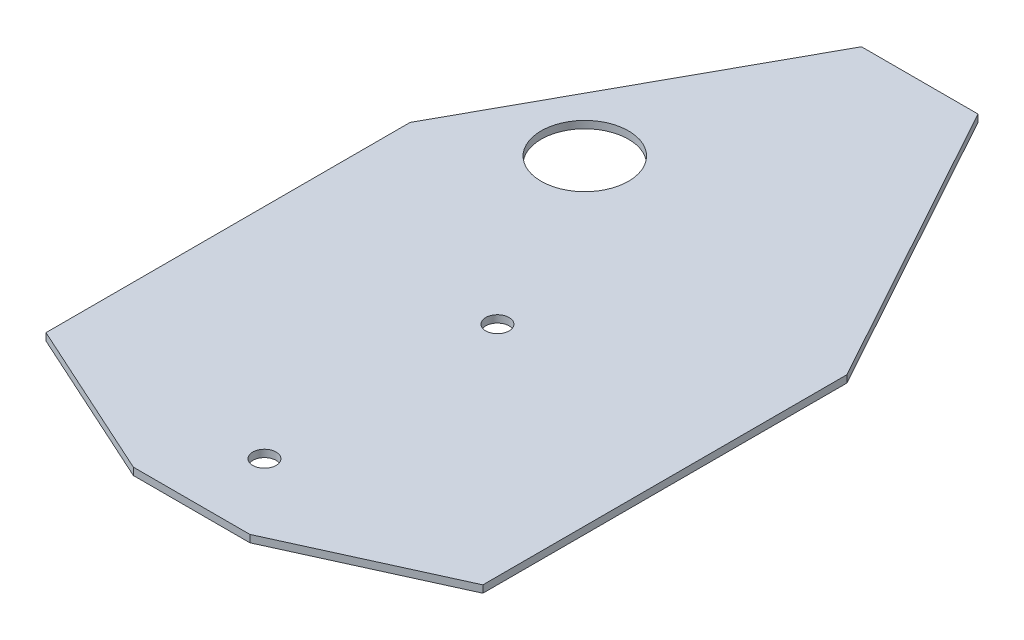
ISO-10303-21;
HEADER;
FILE_DESCRIPTION(('STEP AP214'),'2;1');
FILE_NAME('part.step','',(''),(''),'','','');
FILE_SCHEMA(('AUTOMOTIVE_DESIGN { 1 0 10303 214 1 1 1 1 }'));
ENDSEC;
DATA;
#1=APPLICATION_CONTEXT('core data for automotive mechanical design processes');
#2=APPLICATION_PROTOCOL_DEFINITION('international standard','automotive_design',2000,#1);
#3=PRODUCT_CONTEXT('',#1,'mechanical');
#4=PRODUCT('Part','Part','',(#3));
#5=PRODUCT_RELATED_PRODUCT_CATEGORY('part','',(#4));
#6=PRODUCT_DEFINITION_FORMATION('','',#4);
#7=PRODUCT_DEFINITION_CONTEXT('part definition',#1,'design');
#8=PRODUCT_DEFINITION('design','',#6,#7);
#9=PRODUCT_DEFINITION_SHAPE('','',#8);
#10=(LENGTH_UNIT() NAMED_UNIT(*) SI_UNIT(.MILLI.,.METRE.));
#11=(NAMED_UNIT(*) PLANE_ANGLE_UNIT() SI_UNIT($,.RADIAN.));
#12=(NAMED_UNIT(*) SI_UNIT($,.STERADIAN.) SOLID_ANGLE_UNIT());
#13=UNCERTAINTY_MEASURE_WITH_UNIT(LENGTH_MEASURE(1.E-05),#10,'distance_accuracy_value','');
#14=(GEOMETRIC_REPRESENTATION_CONTEXT(3) GLOBAL_UNCERTAINTY_ASSIGNED_CONTEXT((#13)) GLOBAL_UNIT_ASSIGNED_CONTEXT((#10,
#11,#12)) REPRESENTATION_CONTEXT('',''));
#15=CARTESIAN_POINT('',(0.,0.,0.));
#16=DIRECTION('',(0.,0.,1.));
#17=DIRECTION('',(1.,0.,0.));
#18=AXIS2_PLACEMENT_3D('',#15,#16,#17);
#19=CARTESIAN_POINT('',(-30.,1.,-90.));
#20=DIRECTION('',(0.,-1.,0.));
#21=DIRECTION('',(0.,0.,-1.));
#22=AXIS2_PLACEMENT_3D('',#19,#20,#21);
#23=PLANE('',#22);
#24=CARTESIAN_POINT('',(0.,1.,-32.));
#25=DIRECTION('',(0.,1.,0.));
#26=DIRECTION('',(0.,0.,1.));
#27=AXIS2_PLACEMENT_3D('',#24,#25,#26);
#28=CIRCLE('',#27,1.6);
#29=CARTESIAN_POINT('',(0.,1.,-30.4));
#30=VERTEX_POINT('',#29);
#31=EDGE_CURVE('E228',#30,#30,#28,.T.);
#32=ORIENTED_EDGE('',*,*,#31,.F.);
#33=EDGE_LOOP('',(#32));
#34=FACE_BOUND('',#33,.T.);
#35=DIRECTION('',(-1.,0.,0.));
#36=VECTOR('',#35,1.);
#37=CARTESIAN_POINT('',(-7.99999999999999,1.,-90.));
#38=LINE('',#37,#36);
#39=CARTESIAN_POINT('',(7.99999999999999,1.,-90.));
#40=VERTEX_POINT('',#39);
#41=CARTESIAN_POINT('',(-7.99999999999999,1.,-90.));
#42=VERTEX_POINT('',#41);
#43=EDGE_CURVE('E133',#40,#42,#38,.T.);
#44=ORIENTED_EDGE('',*,*,#43,.T.);
#45=DIRECTION('',(-0.481918749772156,0.,0.876215908676647));
#46=VECTOR('',#45,1.);
#47=CARTESIAN_POINT('',(-7.99999999999999,1.,-90.));
#48=LINE('',#47,#46);
#49=CARTESIAN_POINT('',(-30.,1.,-50.));
#50=VERTEX_POINT('',#49);
#51=EDGE_CURVE('E110',#42,#50,#48,.T.);
#52=ORIENTED_EDGE('',*,*,#51,.T.);
#53=DIRECTION('',(0.,0.,1.));
#54=VECTOR('',#53,1.);
#55=CARTESIAN_POINT('',(-30.,1.,-50.));
#56=LINE('',#55,#54);
#57=CARTESIAN_POINT('',(-30.,1.,0.));
#58=VERTEX_POINT('',#57);
#59=EDGE_CURVE('E136',#50,#58,#56,.T.);
#60=ORIENTED_EDGE('',*,*,#59,.T.);
#61=DIRECTION('',(0.910366477462605,0.,0.413802944301184));
#62=VECTOR('',#61,1.);
#63=CARTESIAN_POINT('',(-7.99999999999999,1.,10.));
#64=LINE('',#63,#62);
#65=CARTESIAN_POINT('',(-7.99999999999999,1.,10.));
#66=VERTEX_POINT('',#65);
#67=EDGE_CURVE('E138',#58,#66,#64,.T.);
#68=ORIENTED_EDGE('',*,*,#67,.T.);
#69=DIRECTION('',(1.,0.,0.));
#70=VECTOR('',#69,1.);
#71=CARTESIAN_POINT('',(-7.99999999999999,1.,10.));
#72=LINE('',#71,#70);
#73=CARTESIAN_POINT('',(8.,1.,10.));
#74=VERTEX_POINT('',#73);
#75=EDGE_CURVE('E140',#66,#74,#72,.T.);
#76=ORIENTED_EDGE('',*,*,#75,.T.);
#77=DIRECTION('',(0.910366477462605,0.,-0.413802944301184));
#78=VECTOR('',#77,1.);
#79=CARTESIAN_POINT('',(30.,1.,0.));
#80=LINE('',#79,#78);
#81=CARTESIAN_POINT('',(30.,1.,0.));
#82=VERTEX_POINT('',#81);
#83=EDGE_CURVE('E142',#74,#82,#80,.T.);
#84=ORIENTED_EDGE('',*,*,#83,.T.);
#85=DIRECTION('',(0.,0.,-1.));
#86=VECTOR('',#85,1.);
#87=CARTESIAN_POINT('',(30.,1.,-50.));
#88=LINE('',#87,#86);
#89=CARTESIAN_POINT('',(30.,1.,-50.));
#90=VERTEX_POINT('',#89);
#91=EDGE_CURVE('E51',#82,#90,#88,.T.);
#92=ORIENTED_EDGE('',*,*,#91,.T.);
#93=DIRECTION('',(-0.481918749772156,0.,-0.876215908676647));
#94=VECTOR('',#93,1.);
#95=CARTESIAN_POINT('',(7.99999999999999,1.,-90.));
#96=LINE('',#95,#94);
#97=EDGE_CURVE('E46',#90,#40,#96,.T.);
#98=ORIENTED_EDGE('',*,*,#97,.T.);
#99=EDGE_LOOP('',(#44,#52,#60,#68,#76,#84,#92,#98));
#100=FACE_BOUND('',#99,.T.);
#101=CARTESIAN_POINT('',(0.,1.,0.));
#102=DIRECTION('',(0.,1.,0.));
#103=DIRECTION('',(0.,0.,1.));
#104=AXIS2_PLACEMENT_3D('',#101,#102,#103);
#105=CIRCLE('',#104,1.6);
#106=CARTESIAN_POINT('',(0.,1.,1.6));
#107=VERTEX_POINT('',#106);
#108=EDGE_CURVE('E115',#107,#107,#105,.T.);
#109=ORIENTED_EDGE('',*,*,#108,.F.);
#110=EDGE_LOOP('',(#109));
#111=FACE_BOUND('',#110,.T.);
#112=CARTESIAN_POINT('',(-14.,1.,-58.));
#113=DIRECTION('',(0.,1.,0.));
#114=DIRECTION('',(0.,0.,1.));
#115=AXIS2_PLACEMENT_3D('',#112,#113,#114);
#116=CIRCLE('',#115,6.);
#117=CARTESIAN_POINT('',(-14.,1.,-52.));
#118=VERTEX_POINT('',#117);
#119=EDGE_CURVE('E217',#118,#118,#116,.T.);
#120=ORIENTED_EDGE('',*,*,#119,.F.);
#121=EDGE_LOOP('',(#120));
#122=FACE_BOUND('',#121,.T.);
#123=ADVANCED_FACE('F31',(#34,#100,#111,#122),#23,.F.);
#124=CARTESIAN_POINT('',(-30.,0.,-90.));
#125=DIRECTION('',(0.,-1.,0.));
#126=DIRECTION('',(0.,0.,-1.));
#127=AXIS2_PLACEMENT_3D('',#124,#125,#126);
#128=PLANE('',#127);
#129=CARTESIAN_POINT('',(0.,0.,-32.));
#130=DIRECTION('',(0.,1.,0.));
#131=DIRECTION('',(0.,0.,1.));
#132=AXIS2_PLACEMENT_3D('',#129,#130,#131);
#133=CIRCLE('',#132,1.6);
#134=CARTESIAN_POINT('',(0.,0.,-30.4));
#135=VERTEX_POINT('',#134);
#136=EDGE_CURVE('E223',#135,#135,#133,.T.);
#137=ORIENTED_EDGE('',*,*,#136,.T.);
#138=EDGE_LOOP('',(#137));
#139=FACE_BOUND('',#138,.T.);
#140=DIRECTION('',(-1.,0.,0.));
#141=VECTOR('',#140,1.);
#142=CARTESIAN_POINT('',(-7.99999999999999,0.,-90.));
#143=LINE('',#142,#141);
#144=CARTESIAN_POINT('',(7.99999999999999,0.,-90.));
#145=VERTEX_POINT('',#144);
#146=CARTESIAN_POINT('',(-7.99999999999999,0.,-90.));
#147=VERTEX_POINT('',#146);
#148=EDGE_CURVE('E101',#145,#147,#143,.T.);
#149=ORIENTED_EDGE('',*,*,#148,.F.);
#150=DIRECTION('',(-0.481918749772156,0.,-0.876215908676647));
#151=VECTOR('',#150,1.);
#152=CARTESIAN_POINT('',(7.99999999999999,0.,-90.));
#153=LINE('',#152,#151);
#154=CARTESIAN_POINT('',(30.,0.,-50.));
#155=VERTEX_POINT('',#154);
#156=EDGE_CURVE('E131',#155,#145,#153,.T.);
#157=ORIENTED_EDGE('',*,*,#156,.F.);
#158=DIRECTION('',(0.,0.,-1.));
#159=VECTOR('',#158,1.);
#160=CARTESIAN_POINT('',(30.,0.,-50.));
#161=LINE('',#160,#159);
#162=CARTESIAN_POINT('',(30.,0.,0.));
#163=VERTEX_POINT('',#162);
#164=EDGE_CURVE('E129',#163,#155,#161,.T.);
#165=ORIENTED_EDGE('',*,*,#164,.F.);
#166=DIRECTION('',(0.910366477462605,0.,-0.413802944301184));
#167=VECTOR('',#166,1.);
#168=CARTESIAN_POINT('',(30.,0.,0.));
#169=LINE('',#168,#167);
#170=CARTESIAN_POINT('',(8.,0.,10.));
#171=VERTEX_POINT('',#170);
#172=EDGE_CURVE('E127',#171,#163,#169,.T.);
#173=ORIENTED_EDGE('',*,*,#172,.F.);
#174=DIRECTION('',(1.,0.,0.));
#175=VECTOR('',#174,1.);
#176=CARTESIAN_POINT('',(-7.99999999999999,0.,10.));
#177=LINE('',#176,#175);
#178=CARTESIAN_POINT('',(-7.99999999999999,0.,10.));
#179=VERTEX_POINT('',#178);
#180=EDGE_CURVE('E125',#179,#171,#177,.T.);
#181=ORIENTED_EDGE('',*,*,#180,.F.);
#182=DIRECTION('',(0.910366477462605,0.,0.413802944301184));
#183=VECTOR('',#182,1.);
#184=CARTESIAN_POINT('',(-7.99999999999999,0.,10.));
#185=LINE('',#184,#183);
#186=CARTESIAN_POINT('',(-30.,0.,0.));
#187=VERTEX_POINT('',#186);
#188=EDGE_CURVE('E123',#187,#179,#185,.T.);
#189=ORIENTED_EDGE('',*,*,#188,.F.);
#190=DIRECTION('',(0.,0.,1.));
#191=VECTOR('',#190,1.);
#192=CARTESIAN_POINT('',(-30.,0.,-50.));
#193=LINE('',#192,#191);
#194=CARTESIAN_POINT('',(-30.,0.,-50.));
#195=VERTEX_POINT('',#194);
#196=EDGE_CURVE('E103',#195,#187,#193,.T.);
#197=ORIENTED_EDGE('',*,*,#196,.F.);
#198=DIRECTION('',(-0.481918749772156,0.,0.876215908676647));
#199=VECTOR('',#198,1.);
#200=CARTESIAN_POINT('',(-7.99999999999999,0.,-90.));
#201=LINE('',#200,#199);
#202=EDGE_CURVE('E96',#147,#195,#201,.T.);
#203=ORIENTED_EDGE('',*,*,#202,.F.);
#204=EDGE_LOOP('',(#149,#157,#165,#173,#181,#189,#197,#203));
#205=FACE_BOUND('',#204,.T.);
#206=CARTESIAN_POINT('',(0.,0.,0.));
#207=DIRECTION('',(0.,1.,0.));
#208=DIRECTION('',(0.,0.,1.));
#209=AXIS2_PLACEMENT_3D('',#206,#207,#208);
#210=CIRCLE('',#209,1.6);
#211=CARTESIAN_POINT('',(0.,0.,1.6));
#212=VERTEX_POINT('',#211);
#213=EDGE_CURVE('E118',#212,#212,#210,.T.);
#214=ORIENTED_EDGE('',*,*,#213,.T.);
#215=EDGE_LOOP('',(#214));
#216=FACE_BOUND('',#215,.T.);
#217=CARTESIAN_POINT('',(-14.,0.,-58.));
#218=DIRECTION('',(0.,1.,0.));
#219=DIRECTION('',(0.,0.,1.));
#220=AXIS2_PLACEMENT_3D('',#217,#218,#219);
#221=CIRCLE('',#220,6.);
#222=CARTESIAN_POINT('',(-14.,0.,-52.));
#223=VERTEX_POINT('',#222);
#224=EDGE_CURVE('E220',#223,#223,#221,.T.);
#225=ORIENTED_EDGE('',*,*,#224,.T.);
#226=EDGE_LOOP('',(#225));
#227=FACE_BOUND('',#226,.T.);
#228=ADVANCED_FACE('F97',(#139,#205,#216,#227),#128,.T.);
#229=CARTESIAN_POINT('',(-7.99999999999999,1.,-90.));
#230=DIRECTION('',(0.,0.,1.));
#231=DIRECTION('',(1.,0.,0.));
#232=AXIS2_PLACEMENT_3D('',#229,#230,#231);
#233=PLANE('',#232);
#234=ORIENTED_EDGE('',*,*,#148,.T.);
#235=DIRECTION('',(0.,-1.,0.));
#236=VECTOR('',#235,1.);
#237=CARTESIAN_POINT('',(-7.99999999999999,1.,-90.));
#238=LINE('',#237,#236);
#239=EDGE_CURVE('E11',#42,#147,#238,.T.);
#240=ORIENTED_EDGE('',*,*,#239,.F.);
#241=ORIENTED_EDGE('',*,*,#43,.F.);
#242=DIRECTION('',(0.,-1.,0.));
#243=VECTOR('',#242,1.);
#244=CARTESIAN_POINT('',(7.99999999999999,1.,-90.));
#245=LINE('',#244,#243);
#246=EDGE_CURVE('E114',#40,#145,#245,.T.);
#247=ORIENTED_EDGE('',*,*,#246,.T.);
#248=EDGE_LOOP('',(#234,#240,#241,#247));
#249=FACE_BOUND('',#248,.T.);
#250=ADVANCED_FACE('F33',(#249),#233,.F.);
#251=CARTESIAN_POINT('',(-7.99999999999999,1.,-90.));
#252=DIRECTION('',(0.876215908676647,0.,0.481918749772156));
#253=DIRECTION('',(0.481918749772156,0.,-0.876215908676647));
#254=AXIS2_PLACEMENT_3D('',#251,#252,#253);
#255=PLANE('',#254);
#256=ORIENTED_EDGE('',*,*,#202,.T.);
#257=DIRECTION('',(0.,-1.,0.));
#258=VECTOR('',#257,1.);
#259=CARTESIAN_POINT('',(-30.,1.,-50.));
#260=LINE('',#259,#258);
#261=EDGE_CURVE('E39',#50,#195,#260,.T.);
#262=ORIENTED_EDGE('',*,*,#261,.F.);
#263=ORIENTED_EDGE('',*,*,#51,.F.);
#264=ORIENTED_EDGE('',*,*,#239,.T.);
#265=EDGE_LOOP('',(#256,#262,#263,#264));
#266=FACE_BOUND('',#265,.T.);
#267=ADVANCED_FACE('F109',(#266),#255,.F.);
#268=CARTESIAN_POINT('',(-30.,1.,-50.));
#269=DIRECTION('',(1.,0.,0.));
#270=DIRECTION('',(0.,0.,-1.));
#271=AXIS2_PLACEMENT_3D('',#268,#269,#270);
#272=PLANE('',#271);
#273=ORIENTED_EDGE('',*,*,#196,.T.);
#274=DIRECTION('',(0.,-1.,0.));
#275=VECTOR('',#274,1.);
#276=CARTESIAN_POINT('',(-30.,1.,0.));
#277=LINE('',#276,#275);
#278=EDGE_CURVE('E159',#58,#187,#277,.T.);
#279=ORIENTED_EDGE('',*,*,#278,.F.);
#280=ORIENTED_EDGE('',*,*,#59,.F.);
#281=ORIENTED_EDGE('',*,*,#261,.T.);
#282=EDGE_LOOP('',(#273,#279,#280,#281));
#283=FACE_BOUND('',#282,.T.);
#284=ADVANCED_FACE('F163',(#283),#272,.F.);
#285=CARTESIAN_POINT('',(-7.99999999999999,1.,10.));
#286=DIRECTION('',(0.413802944301184,0.,-0.910366477462605));
#287=DIRECTION('',(-0.910366477462605,0.,-0.413802944301184));
#288=AXIS2_PLACEMENT_3D('',#285,#286,#287);
#289=PLANE('',#288);
#290=ORIENTED_EDGE('',*,*,#188,.T.);
#291=DIRECTION('',(0.,-1.,0.));
#292=VECTOR('',#291,1.);
#293=CARTESIAN_POINT('',(-7.99999999999999,1.,10.));
#294=LINE('',#293,#292);
#295=EDGE_CURVE('E156',#66,#179,#294,.T.);
#296=ORIENTED_EDGE('',*,*,#295,.F.);
#297=ORIENTED_EDGE('',*,*,#67,.F.);
#298=ORIENTED_EDGE('',*,*,#278,.T.);
#299=EDGE_LOOP('',(#290,#296,#297,#298));
#300=FACE_BOUND('',#299,.T.);
#301=ADVANCED_FACE('F171',(#300),#289,.F.);
#302=CARTESIAN_POINT('',(-7.99999999999999,1.,10.));
#303=DIRECTION('',(0.,0.,-1.));
#304=DIRECTION('',(-1.,0.,0.));
#305=AXIS2_PLACEMENT_3D('',#302,#303,#304);
#306=PLANE('',#305);
#307=ORIENTED_EDGE('',*,*,#180,.T.);
#308=DIRECTION('',(0.,-1.,0.));
#309=VECTOR('',#308,1.);
#310=CARTESIAN_POINT('',(8.,1.,10.));
#311=LINE('',#310,#309);
#312=EDGE_CURVE('E153',#74,#171,#311,.T.);
#313=ORIENTED_EDGE('',*,*,#312,.F.);
#314=ORIENTED_EDGE('',*,*,#75,.F.);
#315=ORIENTED_EDGE('',*,*,#295,.T.);
#316=EDGE_LOOP('',(#307,#313,#314,#315));
#317=FACE_BOUND('',#316,.T.);
#318=ADVANCED_FACE('F174',(#317),#306,.F.);
#319=CARTESIAN_POINT('',(30.,1.,0.));
#320=DIRECTION('',(-0.413802944301184,0.,-0.910366477462605));
#321=DIRECTION('',(-0.910366477462605,0.,0.413802944301184));
#322=AXIS2_PLACEMENT_3D('',#319,#320,#321);
#323=PLANE('',#322);
#324=ORIENTED_EDGE('',*,*,#172,.T.);
#325=DIRECTION('',(0.,-1.,0.));
#326=VECTOR('',#325,1.);
#327=CARTESIAN_POINT('',(30.,1.,0.));
#328=LINE('',#327,#326);
#329=EDGE_CURVE('E150',#82,#163,#328,.T.);
#330=ORIENTED_EDGE('',*,*,#329,.F.);
#331=ORIENTED_EDGE('',*,*,#83,.F.);
#332=ORIENTED_EDGE('',*,*,#312,.T.);
#333=EDGE_LOOP('',(#324,#330,#331,#332));
#334=FACE_BOUND('',#333,.T.);
#335=ADVANCED_FACE('F179',(#334),#323,.F.);
#336=CARTESIAN_POINT('',(30.,1.,-50.));
#337=DIRECTION('',(-1.,0.,0.));
#338=DIRECTION('',(0.,0.,1.));
#339=AXIS2_PLACEMENT_3D('',#336,#337,#338);
#340=PLANE('',#339);
#341=ORIENTED_EDGE('',*,*,#164,.T.);
#342=DIRECTION('',(0.,-1.,0.));
#343=VECTOR('',#342,1.);
#344=CARTESIAN_POINT('',(30.,1.,-50.));
#345=LINE('',#344,#343);
#346=EDGE_CURVE('E147',#90,#155,#345,.T.);
#347=ORIENTED_EDGE('',*,*,#346,.F.);
#348=ORIENTED_EDGE('',*,*,#91,.F.);
#349=ORIENTED_EDGE('',*,*,#329,.T.);
#350=EDGE_LOOP('',(#341,#347,#348,#349));
#351=FACE_BOUND('',#350,.T.);
#352=ADVANCED_FACE('F182',(#351),#340,.F.);
#353=CARTESIAN_POINT('',(7.99999999999999,1.,-90.));
#354=DIRECTION('',(-0.876215908676647,0.,0.481918749772156));
#355=DIRECTION('',(0.481918749772156,0.,0.876215908676647));
#356=AXIS2_PLACEMENT_3D('',#353,#354,#355);
#357=PLANE('',#356);
#358=ORIENTED_EDGE('',*,*,#156,.T.);
#359=ORIENTED_EDGE('',*,*,#246,.F.);
#360=ORIENTED_EDGE('',*,*,#97,.F.);
#361=ORIENTED_EDGE('',*,*,#346,.T.);
#362=EDGE_LOOP('',(#358,#359,#360,#361));
#363=FACE_BOUND('',#362,.T.);
#364=ADVANCED_FACE('F184',(#363),#357,.F.);
#365=CARTESIAN_POINT('',(0.,1.,0.));
#366=DIRECTION('',(0.,-1.,0.));
#367=DIRECTION('',(0.,0.,-1.));
#368=AXIS2_PLACEMENT_3D('',#365,#366,#367);
#369=CYLINDRICAL_SURFACE('',#368,1.6);
#370=ORIENTED_EDGE('',*,*,#108,.T.);
#371=EDGE_LOOP('',(#370));
#372=FACE_BOUND('',#371,.T.);
#373=ORIENTED_EDGE('',*,*,#213,.F.);
#374=EDGE_LOOP('',(#373));
#375=FACE_BOUND('',#374,.T.);
#376=ADVANCED_FACE('F186',(#372,#375),#369,.F.);
#377=CARTESIAN_POINT('',(0.,1.,-32.));
#378=DIRECTION('',(0.,-1.,0.));
#379=DIRECTION('',(0.,0.,-1.));
#380=AXIS2_PLACEMENT_3D('',#377,#378,#379);
#381=CYLINDRICAL_SURFACE('',#380,1.6);
#382=ORIENTED_EDGE('',*,*,#31,.T.);
#383=EDGE_LOOP('',(#382));
#384=FACE_BOUND('',#383,.T.);
#385=ORIENTED_EDGE('',*,*,#136,.F.);
#386=EDGE_LOOP('',(#385));
#387=FACE_BOUND('',#386,.T.);
#388=ADVANCED_FACE('F192',(#384,#387),#381,.F.);
#389=CARTESIAN_POINT('',(-14.,1.,-58.));
#390=DIRECTION('',(0.,-1.,0.));
#391=DIRECTION('',(0.,0.,-1.));
#392=AXIS2_PLACEMENT_3D('',#389,#390,#391);
#393=CYLINDRICAL_SURFACE('',#392,6.);
#394=ORIENTED_EDGE('',*,*,#119,.T.);
#395=EDGE_LOOP('',(#394));
#396=FACE_BOUND('',#395,.T.);
#397=ORIENTED_EDGE('',*,*,#224,.F.);
#398=EDGE_LOOP('',(#397));
#399=FACE_BOUND('',#398,.T.);
#400=ADVANCED_FACE('F208',(#396,#399),#393,.F.);
#401=CLOSED_SHELL('',(#123,#228,#250,#267,#284,#301,#318,#335,#352,#364,#376,#388,#400));
#402=MANIFOLD_SOLID_BREP('B2',#401);
#403=ADVANCED_BREP_SHAPE_REPRESENTATION('',(#18,#402),#14);
#404=SHAPE_DEFINITION_REPRESENTATION(#9,#403);
ENDSEC;
END-ISO-10303-21;
